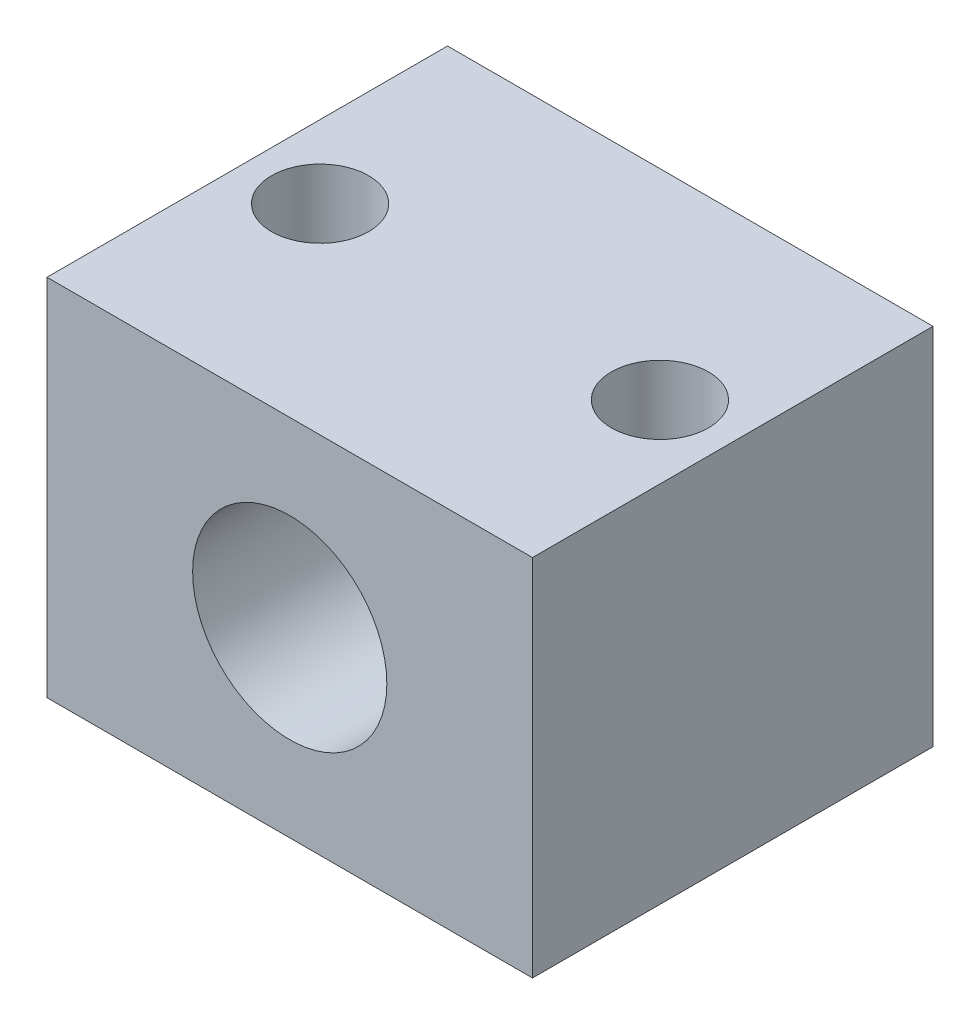
ISO-10303-21;
HEADER;
FILE_DESCRIPTION(('STEP AP214'),'2;1');
FILE_NAME('part.step','',(''),(''),'','','');
FILE_SCHEMA(('AUTOMOTIVE_DESIGN { 1 0 10303 214 1 1 1 1 }'));
ENDSEC;
DATA;
#1=APPLICATION_CONTEXT('core data for automotive mechanical design processes');
#2=APPLICATION_PROTOCOL_DEFINITION('international standard','automotive_design',2000,#1);
#3=PRODUCT_CONTEXT('',#1,'mechanical');
#4=PRODUCT('Part','Part','',(#3));
#5=PRODUCT_RELATED_PRODUCT_CATEGORY('part','',(#4));
#6=PRODUCT_DEFINITION_FORMATION('','',#4);
#7=PRODUCT_DEFINITION_CONTEXT('part definition',#1,'design');
#8=PRODUCT_DEFINITION('design','',#6,#7);
#9=PRODUCT_DEFINITION_SHAPE('','',#8);
#10=(LENGTH_UNIT() NAMED_UNIT(*) SI_UNIT(.MILLI.,.METRE.));
#11=(NAMED_UNIT(*) PLANE_ANGLE_UNIT() SI_UNIT($,.RADIAN.));
#12=(NAMED_UNIT(*) SI_UNIT($,.STERADIAN.) SOLID_ANGLE_UNIT());
#13=UNCERTAINTY_MEASURE_WITH_UNIT(LENGTH_MEASURE(1.E-05),#10,'distance_accuracy_value','');
#14=(GEOMETRIC_REPRESENTATION_CONTEXT(3) GLOBAL_UNCERTAINTY_ASSIGNED_CONTEXT((#13)) GLOBAL_UNIT_ASSIGNED_CONTEXT((#10,
#11,#12)) REPRESENTATION_CONTEXT('',''));
#15=CARTESIAN_POINT('',(0.,0.,0.));
#16=DIRECTION('',(0.,0.,1.));
#17=DIRECTION('',(1.,0.,0.));
#18=AXIS2_PLACEMENT_3D('',#15,#16,#17);
#19=CARTESIAN_POINT('',(-20.,0.,16.5));
#20=DIRECTION('',(0.,0.,1.));
#21=DIRECTION('',(1.,0.,0.));
#22=AXIS2_PLACEMENT_3D('',#19,#20,#21);
#23=PLANE('',#22);
#24=DIRECTION('',(-1.,0.,0.));
#25=VECTOR('',#24,1.);
#26=CARTESIAN_POINT('',(0.,0.,16.5));
#27=LINE('',#26,#25);
#28=CARTESIAN_POINT('',(0.,0.,16.5));
#29=VERTEX_POINT('',#28);
#30=CARTESIAN_POINT('',(-20.,0.,16.5));
#31=VERTEX_POINT('',#30);
#32=EDGE_CURVE('E83',#29,#31,#27,.T.);
#33=ORIENTED_EDGE('',*,*,#32,.T.);
#34=DIRECTION('',(0.,-1.,0.));
#35=VECTOR('',#34,1.);
#36=CARTESIAN_POINT('',(-20.,0.,16.5));
#37=LINE('',#36,#35);
#38=CARTESIAN_POINT('',(-20.,-15.,16.5));
#39=VERTEX_POINT('',#38);
#40=EDGE_CURVE('E78',#31,#39,#37,.T.);
#41=ORIENTED_EDGE('',*,*,#40,.T.);
#42=DIRECTION('',(1.,0.,0.));
#43=VECTOR('',#42,1.);
#44=CARTESIAN_POINT('',(-20.,-15.,16.5));
#45=LINE('',#44,#43);
#46=CARTESIAN_POINT('',(0.,-15.,16.5));
#47=VERTEX_POINT('',#46);
#48=EDGE_CURVE('E81',#39,#47,#45,.T.);
#49=ORIENTED_EDGE('',*,*,#48,.T.);
#50=DIRECTION('',(0.,1.,0.));
#51=VECTOR('',#50,1.);
#52=CARTESIAN_POINT('',(0.,-15.,16.5));
#53=LINE('',#52,#51);
#54=EDGE_CURVE('E48',#47,#29,#53,.T.);
#55=ORIENTED_EDGE('',*,*,#54,.T.);
#56=EDGE_LOOP('',(#33,#41,#49,#55));
#57=FACE_BOUND('',#56,.T.);
#58=CARTESIAN_POINT('',(-10.,-7.5,16.5));
#59=DIRECTION('',(0.,0.,1.));
#60=DIRECTION('',(1.,0.,0.));
#61=AXIS2_PLACEMENT_3D('',#58,#59,#60);
#62=CIRCLE('',#61,4.);
#63=CARTESIAN_POINT('',(-6.,-7.5,16.5));
#64=VERTEX_POINT('',#63);
#65=EDGE_CURVE('E98',#64,#64,#62,.T.);
#66=ORIENTED_EDGE('',*,*,#65,.F.);
#67=EDGE_LOOP('',(#66));
#68=FACE_BOUND('',#67,.T.);
#69=ADVANCED_FACE('F31',(#57,#68),#23,.T.);
#70=CARTESIAN_POINT('',(-20.,0.,0.));
#71=DIRECTION('',(0.,0.,1.));
#72=DIRECTION('',(1.,0.,0.));
#73=AXIS2_PLACEMENT_3D('',#70,#71,#72);
#74=PLANE('',#73);
#75=DIRECTION('',(-1.,0.,0.));
#76=VECTOR('',#75,1.);
#77=CARTESIAN_POINT('',(0.,0.,0.));
#78=LINE('',#77,#76);
#79=CARTESIAN_POINT('',(0.,0.,0.));
#80=VERTEX_POINT('',#79);
#81=CARTESIAN_POINT('',(-20.,0.,0.));
#82=VERTEX_POINT('',#81);
#83=EDGE_CURVE('E95',#80,#82,#78,.T.);
#84=ORIENTED_EDGE('',*,*,#83,.F.);
#85=DIRECTION('',(0.,1.,0.));
#86=VECTOR('',#85,1.);
#87=CARTESIAN_POINT('',(0.,-15.,0.));
#88=LINE('',#87,#86);
#89=CARTESIAN_POINT('',(0.,-15.,0.));
#90=VERTEX_POINT('',#89);
#91=EDGE_CURVE('E71',#90,#80,#88,.T.);
#92=ORIENTED_EDGE('',*,*,#91,.F.);
#93=DIRECTION('',(1.,0.,0.));
#94=VECTOR('',#93,1.);
#95=CARTESIAN_POINT('',(-20.,-15.,0.));
#96=LINE('',#95,#94);
#97=CARTESIAN_POINT('',(-20.,-15.,0.));
#98=VERTEX_POINT('',#97);
#99=EDGE_CURVE('E65',#98,#90,#96,.T.);
#100=ORIENTED_EDGE('',*,*,#99,.F.);
#101=DIRECTION('',(0.,-1.,0.));
#102=VECTOR('',#101,1.);
#103=CARTESIAN_POINT('',(-20.,0.,0.));
#104=LINE('',#103,#102);
#105=EDGE_CURVE('E87',#82,#98,#104,.T.);
#106=ORIENTED_EDGE('',*,*,#105,.F.);
#107=EDGE_LOOP('',(#84,#92,#100,#106));
#108=FACE_BOUND('',#107,.T.);
#109=CARTESIAN_POINT('',(-10.,-7.5,0.));
#110=DIRECTION('',(0.,0.,1.));
#111=DIRECTION('',(1.,0.,0.));
#112=AXIS2_PLACEMENT_3D('',#109,#110,#111);
#113=CIRCLE('',#112,4.);
#114=CARTESIAN_POINT('',(-6.,-7.5,0.));
#115=VERTEX_POINT('',#114);
#116=EDGE_CURVE('E110',#115,#115,#113,.T.);
#117=ORIENTED_EDGE('',*,*,#116,.T.);
#118=EDGE_LOOP('',(#117));
#119=FACE_BOUND('',#118,.T.);
#120=ADVANCED_FACE('F106',(#108,#119),#74,.F.);
#121=CARTESIAN_POINT('',(0.,0.,16.5));
#122=DIRECTION('',(0.,-1.,0.));
#123=DIRECTION('',(1.,0.,0.));
#124=AXIS2_PLACEMENT_3D('',#121,#122,#123);
#125=PLANE('',#124);
#126=CARTESIAN_POINT('',(-3.,0.,8.25));
#127=DIRECTION('',(0.,1.,0.));
#128=DIRECTION('',(-1.,0.,0.));
#129=AXIS2_PLACEMENT_3D('',#126,#127,#128);
#130=CIRCLE('',#129,2.);
#131=CARTESIAN_POINT('',(-5.,0.,8.25));
#132=VERTEX_POINT('',#131);
#133=EDGE_CURVE('E122',#132,#132,#130,.T.);
#134=ORIENTED_EDGE('',*,*,#133,.F.);
#135=EDGE_LOOP('',(#134));
#136=FACE_BOUND('',#135,.T.);
#137=CARTESIAN_POINT('',(-17.,0.,8.25));
#138=DIRECTION('',(0.,1.,0.));
#139=DIRECTION('',(1.,0.,0.));
#140=AXIS2_PLACEMENT_3D('',#137,#138,#139);
#141=CIRCLE('',#140,2.);
#142=CARTESIAN_POINT('',(-15.,0.,8.25));
#143=VERTEX_POINT('',#142);
#144=EDGE_CURVE('E116',#143,#143,#141,.T.);
#145=ORIENTED_EDGE('',*,*,#144,.F.);
#146=EDGE_LOOP('',(#145));
#147=FACE_BOUND('',#146,.T.);
#148=ORIENTED_EDGE('',*,*,#83,.T.);
#149=DIRECTION('',(0.,0.,-1.));
#150=VECTOR('',#149,1.);
#151=CARTESIAN_POINT('',(-20.,0.,16.5));
#152=LINE('',#151,#150);
#153=EDGE_CURVE('E11',#31,#82,#152,.T.);
#154=ORIENTED_EDGE('',*,*,#153,.F.);
#155=ORIENTED_EDGE('',*,*,#32,.F.);
#156=DIRECTION('',(0.,0.,-1.));
#157=VECTOR('',#156,1.);
#158=CARTESIAN_POINT('',(0.,0.,16.5));
#159=LINE('',#158,#157);
#160=EDGE_CURVE('E91',#29,#80,#159,.T.);
#161=ORIENTED_EDGE('',*,*,#160,.T.);
#162=EDGE_LOOP('',(#148,#154,#155,#161));
#163=FACE_BOUND('',#162,.T.);
#164=ADVANCED_FACE('F33',(#136,#147,#163),#125,.F.);
#165=CARTESIAN_POINT('',(-20.,0.,16.5));
#166=DIRECTION('',(1.,0.,0.));
#167=DIRECTION('',(0.,1.,0.));
#168=AXIS2_PLACEMENT_3D('',#165,#166,#167);
#169=PLANE('',#168);
#170=ORIENTED_EDGE('',*,*,#105,.T.);
#171=DIRECTION('',(0.,0.,-1.));
#172=VECTOR('',#171,1.);
#173=CARTESIAN_POINT('',(-20.,-15.,16.5));
#174=LINE('',#173,#172);
#175=EDGE_CURVE('E40',#39,#98,#174,.T.);
#176=ORIENTED_EDGE('',*,*,#175,.F.);
#177=ORIENTED_EDGE('',*,*,#40,.F.);
#178=ORIENTED_EDGE('',*,*,#153,.T.);
#179=EDGE_LOOP('',(#170,#176,#177,#178));
#180=FACE_BOUND('',#179,.T.);
#181=ADVANCED_FACE('F86',(#180),#169,.F.);
#182=CARTESIAN_POINT('',(-20.,-15.,16.5));
#183=DIRECTION('',(0.,1.,0.));
#184=DIRECTION('',(0.,0.,1.));
#185=AXIS2_PLACEMENT_3D('',#182,#183,#184);
#186=PLANE('',#185);
#187=CARTESIAN_POINT('',(-3.,-15.,8.25));
#188=DIRECTION('',(0.,1.,0.));
#189=DIRECTION('',(-1.,0.,0.));
#190=AXIS2_PLACEMENT_3D('',#187,#188,#189);
#191=CIRCLE('',#190,2.);
#192=CARTESIAN_POINT('',(-5.,-15.,8.25));
#193=VERTEX_POINT('',#192);
#194=EDGE_CURVE('E119',#193,#193,#191,.T.);
#195=ORIENTED_EDGE('',*,*,#194,.T.);
#196=EDGE_LOOP('',(#195));
#197=FACE_BOUND('',#196,.T.);
#198=CARTESIAN_POINT('',(-17.,-15.,8.25));
#199=DIRECTION('',(0.,1.,0.));
#200=DIRECTION('',(1.,0.,0.));
#201=AXIS2_PLACEMENT_3D('',#198,#199,#200);
#202=CIRCLE('',#201,2.);
#203=CARTESIAN_POINT('',(-15.,-15.,8.25));
#204=VERTEX_POINT('',#203);
#205=EDGE_CURVE('E113',#204,#204,#202,.T.);
#206=ORIENTED_EDGE('',*,*,#205,.T.);
#207=EDGE_LOOP('',(#206));
#208=FACE_BOUND('',#207,.T.);
#209=ORIENTED_EDGE('',*,*,#99,.T.);
#210=DIRECTION('',(0.,0.,-1.));
#211=VECTOR('',#210,1.);
#212=CARTESIAN_POINT('',(0.,-15.,16.5));
#213=LINE('',#212,#211);
#214=EDGE_CURVE('E88',#47,#90,#213,.T.);
#215=ORIENTED_EDGE('',*,*,#214,.F.);
#216=ORIENTED_EDGE('',*,*,#48,.F.);
#217=ORIENTED_EDGE('',*,*,#175,.T.);
#218=EDGE_LOOP('',(#209,#215,#216,#217));
#219=FACE_BOUND('',#218,.T.);
#220=ADVANCED_FACE('F89',(#197,#208,#219),#186,.F.);
#221=CARTESIAN_POINT('',(0.,-15.,16.5));
#222=DIRECTION('',(-1.,0.,0.));
#223=DIRECTION('',(0.,0.,1.));
#224=AXIS2_PLACEMENT_3D('',#221,#222,#223);
#225=PLANE('',#224);
#226=ORIENTED_EDGE('',*,*,#91,.T.);
#227=ORIENTED_EDGE('',*,*,#160,.F.);
#228=ORIENTED_EDGE('',*,*,#54,.F.);
#229=ORIENTED_EDGE('',*,*,#214,.T.);
#230=EDGE_LOOP('',(#226,#227,#228,#229));
#231=FACE_BOUND('',#230,.T.);
#232=ADVANCED_FACE('F103',(#231),#225,.F.);
#233=CARTESIAN_POINT('',(-10.,-7.5,16.5));
#234=DIRECTION('',(0.,0.,-1.));
#235=DIRECTION('',(-1.,0.,0.));
#236=AXIS2_PLACEMENT_3D('',#233,#234,#235);
#237=CYLINDRICAL_SURFACE('',#236,4.);
#238=ORIENTED_EDGE('',*,*,#65,.T.);
#239=EDGE_LOOP('',(#238));
#240=FACE_BOUND('',#239,.T.);
#241=ORIENTED_EDGE('',*,*,#116,.F.);
#242=EDGE_LOOP('',(#241));
#243=FACE_BOUND('',#242,.T.);
#244=ADVANCED_FACE('F142',(#240,#243),#237,.F.);
#245=CARTESIAN_POINT('',(-17.,-15.,8.25));
#246=DIRECTION('',(0.,1.,0.));
#247=DIRECTION('',(-1.,0.,0.));
#248=AXIS2_PLACEMENT_3D('',#245,#246,#247);
#249=CYLINDRICAL_SURFACE('',#248,2.);
#250=ORIENTED_EDGE('',*,*,#205,.F.);
#251=EDGE_LOOP('',(#250));
#252=FACE_BOUND('',#251,.T.);
#253=ORIENTED_EDGE('',*,*,#144,.T.);
#254=EDGE_LOOP('',(#253));
#255=FACE_BOUND('',#254,.T.);
#256=ADVANCED_FACE('F133',(#252,#255),#249,.F.);
#257=CARTESIAN_POINT('',(-3.,-15.,8.25));
#258=DIRECTION('',(0.,1.,0.));
#259=DIRECTION('',(-1.,0.,0.));
#260=AXIS2_PLACEMENT_3D('',#257,#258,#259);
#261=CYLINDRICAL_SURFACE('',#260,2.);
#262=ORIENTED_EDGE('',*,*,#194,.F.);
#263=EDGE_LOOP('',(#262));
#264=FACE_BOUND('',#263,.T.);
#265=ORIENTED_EDGE('',*,*,#133,.T.);
#266=EDGE_LOOP('',(#265));
#267=FACE_BOUND('',#266,.T.);
#268=ADVANCED_FACE('F130',(#264,#267),#261,.F.);
#269=CLOSED_SHELL('',(#69,#120,#164,#181,#220,#232,#244,#256,#268));
#270=MANIFOLD_SOLID_BREP('B2',#269);
#271=ADVANCED_BREP_SHAPE_REPRESENTATION('',(#18,#270),#14);
#272=SHAPE_DEFINITION_REPRESENTATION(#9,#271);
ENDSEC;
END-ISO-10303-21;
